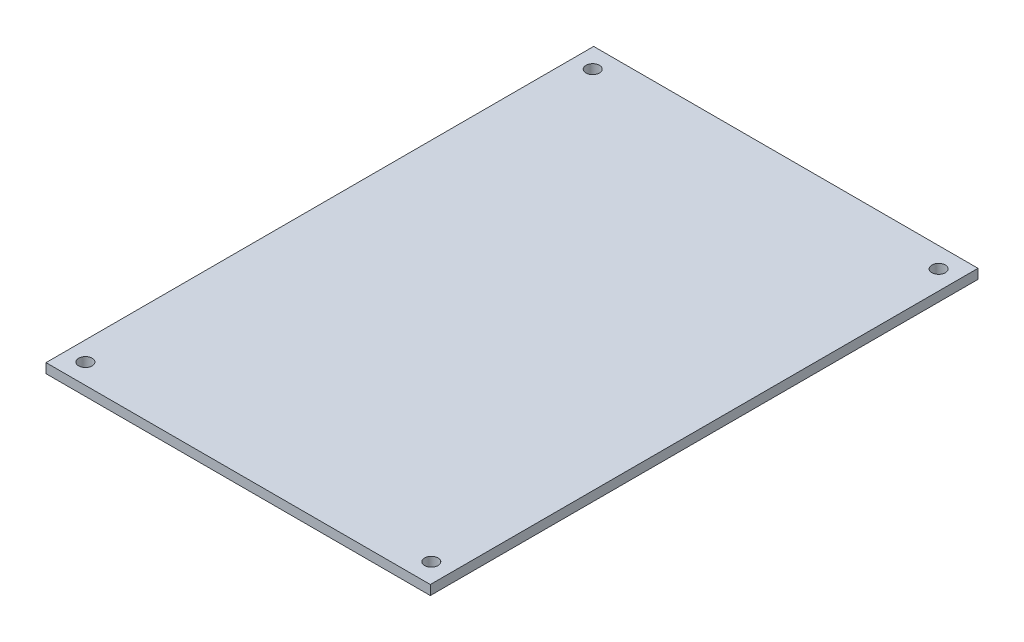
ISO-10303-21;
HEADER;
FILE_DESCRIPTION(('STEP AP214'),'2;1');
FILE_NAME('part.step','',(''),(''),'','','');
FILE_SCHEMA(('AUTOMOTIVE_DESIGN { 1 0 10303 214 1 1 1 1 }'));
ENDSEC;
DATA;
#1=APPLICATION_CONTEXT('core data for automotive mechanical design processes');
#2=APPLICATION_PROTOCOL_DEFINITION('international standard','automotive_design',2000,#1);
#3=PRODUCT_CONTEXT('',#1,'mechanical');
#4=PRODUCT('Part','Part','',(#3));
#5=PRODUCT_RELATED_PRODUCT_CATEGORY('part','',(#4));
#6=PRODUCT_DEFINITION_FORMATION('','',#4);
#7=PRODUCT_DEFINITION_CONTEXT('part definition',#1,'design');
#8=PRODUCT_DEFINITION('design','',#6,#7);
#9=PRODUCT_DEFINITION_SHAPE('','',#8);
#10=(LENGTH_UNIT() NAMED_UNIT(*) SI_UNIT(.MILLI.,.METRE.));
#11=(NAMED_UNIT(*) PLANE_ANGLE_UNIT() SI_UNIT($,.RADIAN.));
#12=(NAMED_UNIT(*) SI_UNIT($,.STERADIAN.) SOLID_ANGLE_UNIT());
#13=UNCERTAINTY_MEASURE_WITH_UNIT(LENGTH_MEASURE(1.E-05),#10,'distance_accuracy_value','');
#14=(GEOMETRIC_REPRESENTATION_CONTEXT(3) GLOBAL_UNCERTAINTY_ASSIGNED_CONTEXT((#13)) GLOBAL_UNIT_ASSIGNED_CONTEXT((#10,
#11,#12)) REPRESENTATION_CONTEXT('',''));
#15=CARTESIAN_POINT('',(0.,0.,0.));
#16=DIRECTION('',(0.,0.,1.));
#17=DIRECTION('',(1.,0.,0.));
#18=AXIS2_PLACEMENT_3D('',#15,#16,#17);
#19=CARTESIAN_POINT('',(-50.8,2.54,-72.39));
#20=DIRECTION('',(1.,0.,0.));
#21=DIRECTION('',(0.,0.,-1.));
#22=AXIS2_PLACEMENT_3D('',#19,#20,#21);
#23=PLANE('',#22);
#24=DIRECTION('',(0.,0.,1.));
#25=VECTOR('',#24,1.);
#26=CARTESIAN_POINT('',(-50.8,0.,-72.39));
#27=LINE('',#26,#25);
#28=CARTESIAN_POINT('',(-50.8,0.,-72.39));
#29=VERTEX_POINT('',#28);
#30=CARTESIAN_POINT('',(-50.8,0.,72.39));
#31=VERTEX_POINT('',#30);
#32=EDGE_CURVE('E96',#29,#31,#27,.T.);
#33=ORIENTED_EDGE('',*,*,#32,.T.);
#34=DIRECTION('',(0.,-1.,0.));
#35=VECTOR('',#34,1.);
#36=CARTESIAN_POINT('',(-50.8,2.54,72.39));
#37=LINE('',#36,#35);
#38=CARTESIAN_POINT('',(-50.8,2.54,72.39));
#39=VERTEX_POINT('',#38);
#40=EDGE_CURVE('E11',#39,#31,#37,.T.);
#41=ORIENTED_EDGE('',*,*,#40,.F.);
#42=DIRECTION('',(0.,0.,1.));
#43=VECTOR('',#42,1.);
#44=CARTESIAN_POINT('',(-50.8,2.54,-72.39));
#45=LINE('',#44,#43);
#46=CARTESIAN_POINT('',(-50.8,2.54,-72.39));
#47=VERTEX_POINT('',#46);
#48=EDGE_CURVE('E84',#47,#39,#45,.T.);
#49=ORIENTED_EDGE('',*,*,#48,.F.);
#50=DIRECTION('',(0.,-1.,0.));
#51=VECTOR('',#50,1.);
#52=CARTESIAN_POINT('',(-50.8,2.54,-72.39));
#53=LINE('',#52,#51);
#54=EDGE_CURVE('E92',#47,#29,#53,.T.);
#55=ORIENTED_EDGE('',*,*,#54,.T.);
#56=EDGE_LOOP('',(#33,#41,#49,#55));
#57=FACE_BOUND('',#56,.T.);
#58=ADVANCED_FACE('F33',(#57),#23,.F.);
#59=CARTESIAN_POINT('',(50.8,2.54,72.39));
#60=DIRECTION('',(0.,0.,-1.));
#61=DIRECTION('',(-1.,0.,0.));
#62=AXIS2_PLACEMENT_3D('',#59,#60,#61);
#63=PLANE('',#62);
#64=DIRECTION('',(1.,0.,0.));
#65=VECTOR('',#64,1.);
#66=CARTESIAN_POINT('',(50.8,0.,72.39));
#67=LINE('',#66,#65);
#68=CARTESIAN_POINT('',(50.8,0.,72.39));
#69=VERTEX_POINT('',#68);
#70=EDGE_CURVE('E88',#31,#69,#67,.T.);
#71=ORIENTED_EDGE('',*,*,#70,.T.);
#72=DIRECTION('',(0.,-1.,0.));
#73=VECTOR('',#72,1.);
#74=CARTESIAN_POINT('',(50.8,2.54,72.39));
#75=LINE('',#74,#73);
#76=CARTESIAN_POINT('',(50.8,2.54,72.39));
#77=VERTEX_POINT('',#76);
#78=EDGE_CURVE('E41',#77,#69,#75,.T.);
#79=ORIENTED_EDGE('',*,*,#78,.F.);
#80=DIRECTION('',(1.,0.,0.));
#81=VECTOR('',#80,1.);
#82=CARTESIAN_POINT('',(50.8,2.54,72.39));
#83=LINE('',#82,#81);
#84=EDGE_CURVE('E79',#39,#77,#83,.T.);
#85=ORIENTED_EDGE('',*,*,#84,.F.);
#86=ORIENTED_EDGE('',*,*,#40,.T.);
#87=EDGE_LOOP('',(#71,#79,#85,#86));
#88=FACE_BOUND('',#87,.T.);
#89=ADVANCED_FACE('F87',(#88),#63,.F.);
#90=CARTESIAN_POINT('',(50.8,2.54,-72.39));
#91=DIRECTION('',(-1.,0.,0.));
#92=DIRECTION('',(0.,0.,1.));
#93=AXIS2_PLACEMENT_3D('',#90,#91,#92);
#94=PLANE('',#93);
#95=DIRECTION('',(0.,0.,-1.));
#96=VECTOR('',#95,1.);
#97=CARTESIAN_POINT('',(50.8,0.,-72.39));
#98=LINE('',#97,#96);
#99=CARTESIAN_POINT('',(50.8,0.,-72.39));
#100=VERTEX_POINT('',#99);
#101=EDGE_CURVE('E66',#69,#100,#98,.T.);
#102=ORIENTED_EDGE('',*,*,#101,.T.);
#103=DIRECTION('',(0.,-1.,0.));
#104=VECTOR('',#103,1.);
#105=CARTESIAN_POINT('',(50.8,2.54,-72.39));
#106=LINE('',#105,#104);
#107=CARTESIAN_POINT('',(50.8,2.54,-72.39));
#108=VERTEX_POINT('',#107);
#109=EDGE_CURVE('E89',#108,#100,#106,.T.);
#110=ORIENTED_EDGE('',*,*,#109,.F.);
#111=DIRECTION('',(0.,0.,-1.));
#112=VECTOR('',#111,1.);
#113=CARTESIAN_POINT('',(50.8,2.54,-72.39));
#114=LINE('',#113,#112);
#115=EDGE_CURVE('E82',#77,#108,#114,.T.);
#116=ORIENTED_EDGE('',*,*,#115,.F.);
#117=ORIENTED_EDGE('',*,*,#78,.T.);
#118=EDGE_LOOP('',(#102,#110,#116,#117));
#119=FACE_BOUND('',#118,.T.);
#120=ADVANCED_FACE('F90',(#119),#94,.F.);
#121=CARTESIAN_POINT('',(50.8,2.54,-72.39));
#122=DIRECTION('',(0.,0.,1.));
#123=DIRECTION('',(1.,0.,0.));
#124=AXIS2_PLACEMENT_3D('',#121,#122,#123);
#125=PLANE('',#124);
#126=DIRECTION('',(-1.,0.,0.));
#127=VECTOR('',#126,1.);
#128=CARTESIAN_POINT('',(50.8,0.,-72.39));
#129=LINE('',#128,#127);
#130=EDGE_CURVE('E72',#100,#29,#129,.T.);
#131=ORIENTED_EDGE('',*,*,#130,.T.);
#132=ORIENTED_EDGE('',*,*,#54,.F.);
#133=DIRECTION('',(-1.,0.,0.));
#134=VECTOR('',#133,1.);
#135=CARTESIAN_POINT('',(50.8,2.54,-72.39));
#136=LINE('',#135,#134);
#137=EDGE_CURVE('E49',#108,#47,#136,.T.);
#138=ORIENTED_EDGE('',*,*,#137,.F.);
#139=ORIENTED_EDGE('',*,*,#109,.T.);
#140=EDGE_LOOP('',(#131,#132,#138,#139));
#141=FACE_BOUND('',#140,.T.);
#142=ADVANCED_FACE('F104',(#141),#125,.F.);
#143=CARTESIAN_POINT('',(0.,2.54,0.));
#144=DIRECTION('',(0.,-1.,0.));
#145=DIRECTION('',(0.,0.,-1.));
#146=AXIS2_PLACEMENT_3D('',#143,#144,#145);
#147=PLANE('',#146);
#148=CARTESIAN_POINT('',(45.72,2.54,-67.056));
#149=DIRECTION('',(0.,1.,0.));
#150=DIRECTION('',(0.,0.,1.));
#151=AXIS2_PLACEMENT_3D('',#148,#149,#150);
#152=CIRCLE('',#151,1.77799999999999);
#153=CARTESIAN_POINT('',(45.72,2.54,-65.278));
#154=VERTEX_POINT('',#153);
#155=EDGE_CURVE('E128',#154,#154,#152,.T.);
#156=ORIENTED_EDGE('',*,*,#155,.F.);
#157=EDGE_LOOP('',(#156));
#158=FACE_BOUND('',#157,.T.);
#159=CARTESIAN_POINT('',(45.72,2.54,67.056));
#160=DIRECTION('',(0.,1.,0.));
#161=DIRECTION('',(0.,0.,1.));
#162=AXIS2_PLACEMENT_3D('',#159,#160,#161);
#163=CIRCLE('',#162,1.77799999999999);
#164=CARTESIAN_POINT('',(45.72,2.54,68.834));
#165=VERTEX_POINT('',#164);
#166=EDGE_CURVE('E122',#165,#165,#163,.T.);
#167=ORIENTED_EDGE('',*,*,#166,.F.);
#168=EDGE_LOOP('',(#167));
#169=FACE_BOUND('',#168,.T.);
#170=CARTESIAN_POINT('',(-45.72,2.54,67.056));
#171=DIRECTION('',(0.,1.,0.));
#172=DIRECTION('',(0.,0.,1.));
#173=AXIS2_PLACEMENT_3D('',#170,#171,#172);
#174=CIRCLE('',#173,1.77799999999999);
#175=CARTESIAN_POINT('',(-45.72,2.54,68.834));
#176=VERTEX_POINT('',#175);
#177=EDGE_CURVE('E116',#176,#176,#174,.T.);
#178=ORIENTED_EDGE('',*,*,#177,.F.);
#179=EDGE_LOOP('',(#178));
#180=FACE_BOUND('',#179,.T.);
#181=CARTESIAN_POINT('',(-45.72,2.54,-67.056));
#182=DIRECTION('',(0.,1.,0.));
#183=DIRECTION('',(0.,0.,1.));
#184=AXIS2_PLACEMENT_3D('',#181,#182,#183);
#185=CIRCLE('',#184,1.77799999999999);
#186=CARTESIAN_POINT('',(-45.72,2.54,-65.278));
#187=VERTEX_POINT('',#186);
#188=EDGE_CURVE('E110',#187,#187,#185,.T.);
#189=ORIENTED_EDGE('',*,*,#188,.F.);
#190=EDGE_LOOP('',(#189));
#191=FACE_BOUND('',#190,.T.);
#192=ORIENTED_EDGE('',*,*,#48,.T.);
#193=ORIENTED_EDGE('',*,*,#84,.T.);
#194=ORIENTED_EDGE('',*,*,#115,.T.);
#195=ORIENTED_EDGE('',*,*,#137,.T.);
#196=EDGE_LOOP('',(#192,#193,#194,#195));
#197=FACE_BOUND('',#196,.T.);
#198=ADVANCED_FACE('F80',(#158,#169,#180,#191,#197),#147,.F.);
#199=CARTESIAN_POINT('',(0.,0.,0.));
#200=DIRECTION('',(0.,-1.,0.));
#201=DIRECTION('',(0.,0.,-1.));
#202=AXIS2_PLACEMENT_3D('',#199,#200,#201);
#203=PLANE('',#202);
#204=CARTESIAN_POINT('',(45.72,0.,-67.056));
#205=DIRECTION('',(0.,1.,0.));
#206=DIRECTION('',(0.,0.,1.));
#207=AXIS2_PLACEMENT_3D('',#204,#205,#206);
#208=CIRCLE('',#207,1.77799999999999);
#209=CARTESIAN_POINT('',(45.72,0.,-65.278));
#210=VERTEX_POINT('',#209);
#211=EDGE_CURVE('E125',#210,#210,#208,.T.);
#212=ORIENTED_EDGE('',*,*,#211,.T.);
#213=EDGE_LOOP('',(#212));
#214=FACE_BOUND('',#213,.T.);
#215=CARTESIAN_POINT('',(45.72,0.,67.056));
#216=DIRECTION('',(0.,1.,0.));
#217=DIRECTION('',(0.,0.,1.));
#218=AXIS2_PLACEMENT_3D('',#215,#216,#217);
#219=CIRCLE('',#218,1.77799999999999);
#220=CARTESIAN_POINT('',(45.72,0.,68.834));
#221=VERTEX_POINT('',#220);
#222=EDGE_CURVE('E119',#221,#221,#219,.T.);
#223=ORIENTED_EDGE('',*,*,#222,.T.);
#224=EDGE_LOOP('',(#223));
#225=FACE_BOUND('',#224,.T.);
#226=CARTESIAN_POINT('',(-45.72,0.,67.056));
#227=DIRECTION('',(0.,1.,0.));
#228=DIRECTION('',(0.,0.,1.));
#229=AXIS2_PLACEMENT_3D('',#226,#227,#228);
#230=CIRCLE('',#229,1.77799999999999);
#231=CARTESIAN_POINT('',(-45.72,0.,68.834));
#232=VERTEX_POINT('',#231);
#233=EDGE_CURVE('E113',#232,#232,#230,.T.);
#234=ORIENTED_EDGE('',*,*,#233,.T.);
#235=EDGE_LOOP('',(#234));
#236=FACE_BOUND('',#235,.T.);
#237=CARTESIAN_POINT('',(-45.72,0.,-67.056));
#238=DIRECTION('',(0.,1.,0.));
#239=DIRECTION('',(0.,0.,1.));
#240=AXIS2_PLACEMENT_3D('',#237,#238,#239);
#241=CIRCLE('',#240,1.77799999999999);
#242=CARTESIAN_POINT('',(-45.72,0.,-65.278));
#243=VERTEX_POINT('',#242);
#244=EDGE_CURVE('E99',#243,#243,#241,.T.);
#245=ORIENTED_EDGE('',*,*,#244,.T.);
#246=EDGE_LOOP('',(#245));
#247=FACE_BOUND('',#246,.T.);
#248=ORIENTED_EDGE('',*,*,#32,.F.);
#249=ORIENTED_EDGE('',*,*,#130,.F.);
#250=ORIENTED_EDGE('',*,*,#101,.F.);
#251=ORIENTED_EDGE('',*,*,#70,.F.);
#252=EDGE_LOOP('',(#248,#249,#250,#251));
#253=FACE_BOUND('',#252,.T.);
#254=ADVANCED_FACE('F107',(#214,#225,#236,#247,#253),#203,.T.);
#255=CARTESIAN_POINT('',(-45.72,0.,-67.056));
#256=DIRECTION('',(0.,1.,0.));
#257=DIRECTION('',(0.,0.,1.));
#258=AXIS2_PLACEMENT_3D('',#255,#256,#257);
#259=CYLINDRICAL_SURFACE('',#258,1.77799999999999);
#260=ORIENTED_EDGE('',*,*,#244,.F.);
#261=EDGE_LOOP('',(#260));
#262=FACE_BOUND('',#261,.T.);
#263=ORIENTED_EDGE('',*,*,#188,.T.);
#264=EDGE_LOOP('',(#263));
#265=FACE_BOUND('',#264,.T.);
#266=ADVANCED_FACE('F152',(#262,#265),#259,.F.);
#267=CARTESIAN_POINT('',(-45.72,0.,67.056));
#268=DIRECTION('',(0.,1.,0.));
#269=DIRECTION('',(0.,0.,1.));
#270=AXIS2_PLACEMENT_3D('',#267,#268,#269);
#271=CYLINDRICAL_SURFACE('',#270,1.77799999999999);
#272=ORIENTED_EDGE('',*,*,#233,.F.);
#273=EDGE_LOOP('',(#272));
#274=FACE_BOUND('',#273,.T.);
#275=ORIENTED_EDGE('',*,*,#177,.T.);
#276=EDGE_LOOP('',(#275));
#277=FACE_BOUND('',#276,.T.);
#278=ADVANCED_FACE('F154',(#274,#277),#271,.F.);
#279=CARTESIAN_POINT('',(45.72,0.,67.056));
#280=DIRECTION('',(0.,1.,0.));
#281=DIRECTION('',(0.,0.,1.));
#282=AXIS2_PLACEMENT_3D('',#279,#280,#281);
#283=CYLINDRICAL_SURFACE('',#282,1.77799999999999);
#284=ORIENTED_EDGE('',*,*,#222,.F.);
#285=EDGE_LOOP('',(#284));
#286=FACE_BOUND('',#285,.T.);
#287=ORIENTED_EDGE('',*,*,#166,.T.);
#288=EDGE_LOOP('',(#287));
#289=FACE_BOUND('',#288,.T.);
#290=ADVANCED_FACE('F139',(#286,#289),#283,.F.);
#291=CARTESIAN_POINT('',(45.72,0.,-67.056));
#292=DIRECTION('',(0.,1.,0.));
#293=DIRECTION('',(0.,0.,1.));
#294=AXIS2_PLACEMENT_3D('',#291,#292,#293);
#295=CYLINDRICAL_SURFACE('',#294,1.77799999999999);
#296=ORIENTED_EDGE('',*,*,#211,.F.);
#297=EDGE_LOOP('',(#296));
#298=FACE_BOUND('',#297,.T.);
#299=ORIENTED_EDGE('',*,*,#155,.T.);
#300=EDGE_LOOP('',(#299));
#301=FACE_BOUND('',#300,.T.);
#302=ADVANCED_FACE('F136',(#298,#301),#295,.F.);
#303=CLOSED_SHELL('',(#58,#89,#120,#142,#198,#254,#266,#278,#290,#302));
#304=MANIFOLD_SOLID_BREP('B2',#303);
#305=ADVANCED_BREP_SHAPE_REPRESENTATION('',(#18,#304),#14);
#306=SHAPE_DEFINITION_REPRESENTATION(#9,#305);
ENDSEC;
END-ISO-10303-21;
